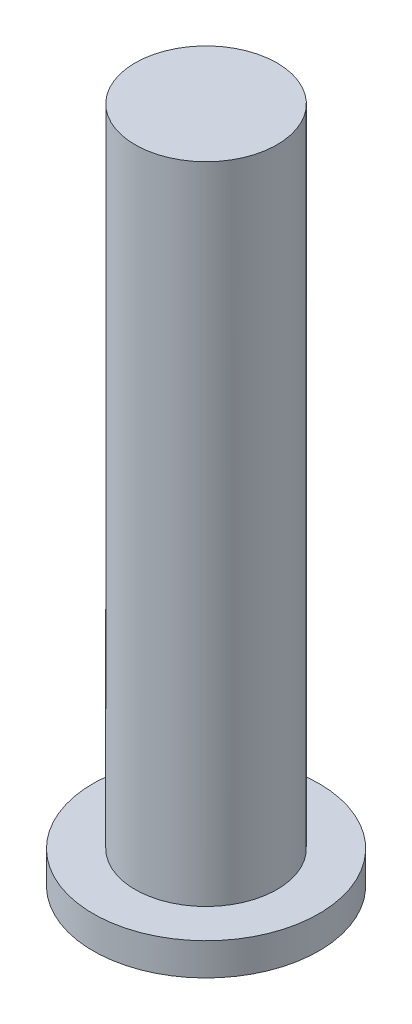
ISO-10303-21;
HEADER;
FILE_DESCRIPTION(('STEP AP214'),'2;1');
FILE_NAME('part.step','',(''),(''),'','','');
FILE_SCHEMA(('AUTOMOTIVE_DESIGN { 1 0 10303 214 1 1 1 1 }'));
ENDSEC;
DATA;
#1=APPLICATION_CONTEXT('core data for automotive mechanical design processes');
#2=APPLICATION_PROTOCOL_DEFINITION('international standard','automotive_design',2000,#1);
#3=PRODUCT_CONTEXT('',#1,'mechanical');
#4=PRODUCT('Part','Part','',(#3));
#5=PRODUCT_RELATED_PRODUCT_CATEGORY('part','',(#4));
#6=PRODUCT_DEFINITION_FORMATION('','',#4);
#7=PRODUCT_DEFINITION_CONTEXT('part definition',#1,'design');
#8=PRODUCT_DEFINITION('design','',#6,#7);
#9=PRODUCT_DEFINITION_SHAPE('','',#8);
#10=(LENGTH_UNIT() NAMED_UNIT(*) SI_UNIT(.MILLI.,.METRE.));
#11=(NAMED_UNIT(*) PLANE_ANGLE_UNIT() SI_UNIT($,.RADIAN.));
#12=(NAMED_UNIT(*) SI_UNIT($,.STERADIAN.) SOLID_ANGLE_UNIT());
#13=UNCERTAINTY_MEASURE_WITH_UNIT(LENGTH_MEASURE(1.E-05),#10,'distance_accuracy_value','');
#14=(GEOMETRIC_REPRESENTATION_CONTEXT(3) GLOBAL_UNCERTAINTY_ASSIGNED_CONTEXT((#13)) GLOBAL_UNIT_ASSIGNED_CONTEXT((#10,
#11,#12)) REPRESENTATION_CONTEXT('',''));
#15=CARTESIAN_POINT('',(0.,0.,0.));
#16=DIRECTION('',(0.,0.,1.));
#17=DIRECTION('',(1.,0.,0.));
#18=AXIS2_PLACEMENT_3D('',#15,#16,#17);
#19=CARTESIAN_POINT('',(96.9527047234491,0.,-8.68314407090655));
#20=DIRECTION('',(0.,-1.,0.));
#21=DIRECTION('',(0.,0.,-1.));
#22=AXIS2_PLACEMENT_3D('',#19,#20,#21);
#23=PLANE('',#22);
#24=CARTESIAN_POINT('',(96.9527047234491,0.,-8.68314407090655));
#25=DIRECTION('',(0.,-1.,0.));
#26=DIRECTION('',(0.,0.,-1.));
#27=AXIS2_PLACEMENT_3D('',#24,#25,#26);
#28=CIRCLE('',#27,3.50000000000001);
#29=CARTESIAN_POINT('',(96.9527047234491,0.,-12.1831440709066));
#30=VERTEX_POINT('',#29);
#31=EDGE_CURVE('E44',#30,#30,#28,.T.);
#32=ORIENTED_EDGE('',*,*,#31,.F.);
#33=EDGE_LOOP('',(#32));
#34=FACE_BOUND('',#33,.T.);
#35=CARTESIAN_POINT('',(96.9527047234491,0.,-8.68314407090655));
#36=DIRECTION('',(0.,-1.,0.));
#37=DIRECTION('',(0.,0.,-1.));
#38=AXIS2_PLACEMENT_3D('',#35,#36,#37);
#39=CIRCLE('',#38,2.2);
#40=CARTESIAN_POINT('',(96.9527047234491,0.,-10.8831440709065));
#41=VERTEX_POINT('',#40);
#42=EDGE_CURVE('E10',#41,#41,#39,.F.);
#43=ORIENTED_EDGE('',*,*,#42,.F.);
#44=EDGE_LOOP('',(#43));
#45=FACE_BOUND('',#44,.T.);
#46=ADVANCED_FACE('F33',(#34,#45),#23,.F.);
#47=CARTESIAN_POINT('',(96.9527047234491,-1.,-8.68314407090655));
#48=DIRECTION('',(0.,-1.,0.));
#49=DIRECTION('',(0.,0.,-1.));
#50=AXIS2_PLACEMENT_3D('',#47,#48,#49);
#51=PLANE('',#50);
#52=CARTESIAN_POINT('',(96.9527047234491,-1.,-8.68314407090655));
#53=DIRECTION('',(0.,-1.,0.));
#54=DIRECTION('',(0.,0.,-1.));
#55=AXIS2_PLACEMENT_3D('',#52,#53,#54);
#56=CIRCLE('',#55,3.50000000000001);
#57=CARTESIAN_POINT('',(96.9527047234491,-1.,-12.1831440709066));
#58=VERTEX_POINT('',#57);
#59=EDGE_CURVE('E40',#58,#58,#56,.T.);
#60=ORIENTED_EDGE('',*,*,#59,.T.);
#61=EDGE_LOOP('',(#60));
#62=FACE_BOUND('',#61,.T.);
#63=CARTESIAN_POINT('',(96.9527047234491,-1.,-8.68314407090655));
#64=DIRECTION('',(0.,-1.,0.));
#65=DIRECTION('',(0.,0.,-1.));
#66=AXIS2_PLACEMENT_3D('',#63,#64,#65);
#67=CIRCLE('',#66,1.65);
#68=CARTESIAN_POINT('',(96.9527047234491,-1.,-10.3331440709066));
#69=VERTEX_POINT('',#68);
#70=EDGE_CURVE('E49',#69,#69,#67,.T.);
#71=ORIENTED_EDGE('',*,*,#70,.F.);
#72=EDGE_LOOP('',(#71));
#73=FACE_BOUND('',#72,.T.);
#74=ADVANCED_FACE('F74',(#62,#73),#51,.T.);
#75=CARTESIAN_POINT('',(96.9527047234491,-1.,-8.68314407090655));
#76=DIRECTION('',(0.,1.,0.));
#77=DIRECTION('',(0.,0.,1.));
#78=AXIS2_PLACEMENT_3D('',#75,#76,#77);
#79=CYLINDRICAL_SURFACE('',#78,3.50000000000001);
#80=ORIENTED_EDGE('',*,*,#59,.F.);
#81=EDGE_LOOP('',(#80));
#82=FACE_BOUND('',#81,.T.);
#83=ORIENTED_EDGE('',*,*,#31,.T.);
#84=EDGE_LOOP('',(#83));
#85=FACE_BOUND('',#84,.T.);
#86=ADVANCED_FACE('F35',(#82,#85),#79,.T.);
#87=CARTESIAN_POINT('',(96.9527047234491,-1.,-8.68314407090655));
#88=DIRECTION('',(0.,1.,0.));
#89=DIRECTION('',(0.,0.,1.));
#90=AXIS2_PLACEMENT_3D('',#87,#88,#89);
#91=CYLINDRICAL_SURFACE('',#90,1.65);
#92=ORIENTED_EDGE('',*,*,#70,.T.);
#93=EDGE_LOOP('',(#92));
#94=FACE_BOUND('',#93,.T.);
#95=CARTESIAN_POINT('',(96.9527047234491,10.,-8.68314407090655));
#96=DIRECTION('',(0.,-1.,0.));
#97=DIRECTION('',(1.,0.,0.));
#98=AXIS2_PLACEMENT_3D('',#95,#96,#97);
#99=CIRCLE('',#98,1.65);
#100=CARTESIAN_POINT('',(98.6027047234491,10.,-8.68314407090655));
#101=VERTEX_POINT('',#100);
#102=EDGE_CURVE('E56',#101,#101,#99,.T.);
#103=ORIENTED_EDGE('',*,*,#102,.F.);
#104=EDGE_LOOP('',(#103));
#105=FACE_BOUND('',#104,.T.);
#106=ADVANCED_FACE('F62',(#94,#105),#91,.F.);
#107=CARTESIAN_POINT('',(96.9527047234491,20.,-8.68314407090655));
#108=DIRECTION('',(0.,-1.,0.));
#109=DIRECTION('',(1.,0.,0.));
#110=AXIS2_PLACEMENT_3D('',#107,#108,#109);
#111=CYLINDRICAL_SURFACE('',#110,2.2);
#112=CARTESIAN_POINT('',(96.9527047234491,20.,-8.68314407090655));
#113=DIRECTION('',(0.,1.,0.));
#114=DIRECTION('',(-1.,0.,0.));
#115=AXIS2_PLACEMENT_3D('',#112,#113,#114);
#116=CIRCLE('',#115,2.2);
#117=CARTESIAN_POINT('',(94.7527047234491,20.,-8.68314407090655));
#118=VERTEX_POINT('',#117);
#119=EDGE_CURVE('E53',#118,#118,#116,.T.);
#120=ORIENTED_EDGE('',*,*,#119,.F.);
#121=EDGE_LOOP('',(#120));
#122=FACE_BOUND('',#121,.T.);
#123=ORIENTED_EDGE('',*,*,#42,.T.);
#124=EDGE_LOOP('',(#123));
#125=FACE_BOUND('',#124,.T.);
#126=ADVANCED_FACE('F64',(#122,#125),#111,.T.);
#127=CARTESIAN_POINT('',(96.9527047234491,20.,-8.68314407090655));
#128=DIRECTION('',(0.,1.,0.));
#129=DIRECTION('',(-1.,0.,0.));
#130=AXIS2_PLACEMENT_3D('',#127,#128,#129);
#131=PLANE('',#130);
#132=ORIENTED_EDGE('',*,*,#119,.T.);
#133=EDGE_LOOP('',(#132));
#134=FACE_BOUND('',#133,.T.);
#135=ADVANCED_FACE('F71',(#134),#131,.T.);
#136=CARTESIAN_POINT('',(96.9527047234491,10.,-8.68314407090655));
#137=DIRECTION('',(0.,-1.,0.));
#138=DIRECTION('',(1.,0.,0.));
#139=AXIS2_PLACEMENT_3D('',#136,#137,#138);
#140=PLANE('',#139);
#141=ORIENTED_EDGE('',*,*,#102,.T.);
#142=EDGE_LOOP('',(#141));
#143=FACE_BOUND('',#142,.T.);
#144=ADVANCED_FACE('F60',(#143),#140,.T.);
#145=CLOSED_SHELL('',(#46,#74,#86,#106,#126,#135,#144));
#146=MANIFOLD_SOLID_BREP('B2',#145);
#147=ADVANCED_BREP_SHAPE_REPRESENTATION('',(#18,#146),#14);
#148=SHAPE_DEFINITION_REPRESENTATION(#9,#147);
ENDSEC;
END-ISO-10303-21;
